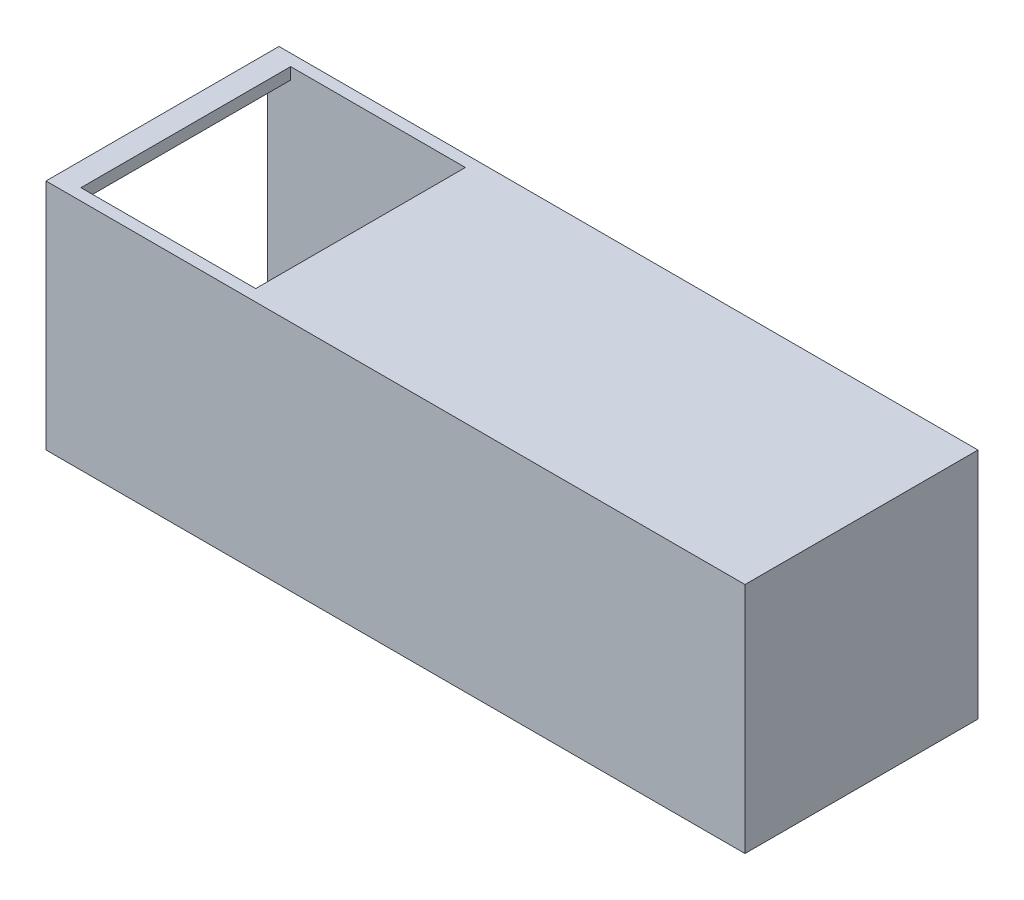
ISO-10303-21;
HEADER;
FILE_DESCRIPTION(('STEP AP214'),'2;1');
FILE_NAME('part.step','',(''),(''),'','','');
FILE_SCHEMA(('AUTOMOTIVE_DESIGN { 1 0 10303 214 1 1 1 1 }'));
ENDSEC;
DATA;
#1=APPLICATION_CONTEXT('core data for automotive mechanical design processes');
#2=APPLICATION_PROTOCOL_DEFINITION('international standard','automotive_design',2000,#1);
#3=PRODUCT_CONTEXT('',#1,'mechanical');
#4=PRODUCT('Part','Part','',(#3));
#5=PRODUCT_RELATED_PRODUCT_CATEGORY('part','',(#4));
#6=PRODUCT_DEFINITION_FORMATION('','',#4);
#7=PRODUCT_DEFINITION_CONTEXT('part definition',#1,'design');
#8=PRODUCT_DEFINITION('design','',#6,#7);
#9=PRODUCT_DEFINITION_SHAPE('','',#8);
#10=(LENGTH_UNIT() NAMED_UNIT(*) SI_UNIT(.MILLI.,.METRE.));
#11=(NAMED_UNIT(*) PLANE_ANGLE_UNIT() SI_UNIT($,.RADIAN.));
#12=(NAMED_UNIT(*) SI_UNIT($,.STERADIAN.) SOLID_ANGLE_UNIT());
#13=UNCERTAINTY_MEASURE_WITH_UNIT(LENGTH_MEASURE(1.E-05),#10,'distance_accuracy_value','');
#14=(GEOMETRIC_REPRESENTATION_CONTEXT(3) GLOBAL_UNCERTAINTY_ASSIGNED_CONTEXT((#13)) GLOBAL_UNIT_ASSIGNED_CONTEXT((#10,
#11,#12)) REPRESENTATION_CONTEXT('',''));
#15=CARTESIAN_POINT('',(0.,0.,0.));
#16=DIRECTION('',(0.,0.,1.));
#17=DIRECTION('',(1.,0.,0.));
#18=AXIS2_PLACEMENT_3D('',#15,#16,#17);
#19=CARTESIAN_POINT('',(0.,38.,0.));
#20=DIRECTION('',(0.,1.,0.));
#21=DIRECTION('',(0.,0.,1.));
#22=AXIS2_PLACEMENT_3D('',#19,#20,#21);
#23=PLANE('',#22);
#24=DIRECTION('',(-1.,0.,0.));
#25=VECTOR('',#24,1.);
#26=CARTESIAN_POINT('',(0.,38.,-38.));
#27=LINE('',#26,#25);
#28=CARTESIAN_POINT('',(-116.,38.,-38.));
#29=VERTEX_POINT('',#28);
#30=CARTESIAN_POINT('',(-120.,38.,-38.));
#31=VERTEX_POINT('',#30);
#32=EDGE_CURVE('E156',#29,#31,#27,.T.);
#33=ORIENTED_EDGE('',*,*,#32,.F.);
#34=DIRECTION('',(0.,0.,-1.));
#35=VECTOR('',#34,1.);
#36=CARTESIAN_POINT('',(-116.,38.,-38.));
#37=LINE('',#36,#35);
#38=CARTESIAN_POINT('',(-116.,38.,-1.99999999999999));
#39=VERTEX_POINT('',#38);
#40=EDGE_CURVE('E141',#39,#29,#37,.T.);
#41=ORIENTED_EDGE('',*,*,#40,.F.);
#42=DIRECTION('',(1.,0.,0.));
#43=VECTOR('',#42,1.);
#44=CARTESIAN_POINT('',(0.,38.,-2.));
#45=LINE('',#44,#43);
#46=CARTESIAN_POINT('',(-120.,38.,-1.99999999999999));
#47=VERTEX_POINT('',#46);
#48=EDGE_CURVE('E154',#47,#39,#45,.T.);
#49=ORIENTED_EDGE('',*,*,#48,.F.);
#50=DIRECTION('',(0.,0.,1.));
#51=VECTOR('',#50,1.);
#52=CARTESIAN_POINT('',(-120.,38.,0.));
#53=LINE('',#52,#51);
#54=EDGE_CURVE('E171',#31,#47,#53,.T.);
#55=ORIENTED_EDGE('',*,*,#54,.F.);
#56=EDGE_LOOP('',(#33,#41,#49,#55));
#57=FACE_BOUND('',#56,.T.);
#58=ADVANCED_FACE('F42',(#57),#23,.F.);
#59=CARTESIAN_POINT('',(0.,2.,0.));
#60=DIRECTION('',(0.,1.,0.));
#61=DIRECTION('',(0.,0.,1.));
#62=AXIS2_PLACEMENT_3D('',#59,#60,#61);
#63=PLANE('',#62);
#64=CARTESIAN_POINT('',(-20.,2.,-20.));
#65=DIRECTION('',(0.,1.,0.));
#66=DIRECTION('',(0.,0.,1.));
#67=AXIS2_PLACEMENT_3D('',#64,#65,#66);
#68=CIRCLE('',#67,18.);
#69=CARTESIAN_POINT('',(-20.,2.,-2.));
#70=VERTEX_POINT('',#69);
#71=CARTESIAN_POINT('',(-2.,2.,-20.));
#72=VERTEX_POINT('',#71);
#73=EDGE_CURVE('E242',#70,#72,#68,.T.);
#74=ORIENTED_EDGE('',*,*,#73,.F.);
#75=DIRECTION('',(1.,0.,0.));
#76=VECTOR('',#75,1.);
#77=CARTESIAN_POINT('',(0.,2.,-2.));
#78=LINE('',#77,#76);
#79=CARTESIAN_POINT('',(-2.,2.,-2.));
#80=VERTEX_POINT('',#79);
#81=EDGE_CURVE('E181',#70,#80,#78,.T.);
#82=ORIENTED_EDGE('',*,*,#81,.T.);
#83=DIRECTION('',(0.,0.,-1.));
#84=VECTOR('',#83,1.);
#85=CARTESIAN_POINT('',(-2.,2.,0.));
#86=LINE('',#85,#84);
#87=EDGE_CURVE('E251',#80,#72,#86,.T.);
#88=ORIENTED_EDGE('',*,*,#87,.T.);
#89=EDGE_LOOP('',(#74,#82,#88));
#90=FACE_BOUND('',#89,.T.);
#91=ADVANCED_FACE('F249',(#90),#63,.T.);
#92=CARTESIAN_POINT('',(-20.,2.,-20.));
#93=DIRECTION('',(0.,1.,0.));
#94=DIRECTION('',(0.,0.,1.));
#95=AXIS2_PLACEMENT_3D('',#92,#93,#94);
#96=CIRCLE('',#95,18.);
#97=CARTESIAN_POINT('',(-20.,2.,-38.));
#98=VERTEX_POINT('',#97);
#99=EDGE_CURVE('E11',#72,#98,#96,.T.);
#100=ORIENTED_EDGE('',*,*,#99,.F.);
#101=CARTESIAN_POINT('',(-2.,2.,-38.));
#102=VERTEX_POINT('',#101);
#103=EDGE_CURVE('E285',#72,#102,#86,.T.);
#104=ORIENTED_EDGE('',*,*,#103,.T.);
#105=DIRECTION('',(-1.,0.,0.));
#106=VECTOR('',#105,1.);
#107=CARTESIAN_POINT('',(0.,2.,-38.));
#108=LINE('',#107,#106);
#109=EDGE_CURVE('E190',#102,#98,#108,.T.);
#110=ORIENTED_EDGE('',*,*,#109,.T.);
#111=EDGE_LOOP('',(#100,#104,#110));
#112=FACE_BOUND('',#111,.T.);
#113=ADVANCED_FACE('F322',(#112),#63,.T.);
#114=CARTESIAN_POINT('',(-120.,40.,0.));
#115=DIRECTION('',(1.,0.,0.));
#116=DIRECTION('',(0.,0.,-1.));
#117=AXIS2_PLACEMENT_3D('',#114,#115,#116);
#118=PLANE('',#117);
#119=DIRECTION('',(0.,0.,1.));
#120=VECTOR('',#119,1.);
#121=CARTESIAN_POINT('',(-120.,0.,0.));
#122=LINE('',#121,#120);
#123=CARTESIAN_POINT('',(-120.,0.,-40.));
#124=VERTEX_POINT('',#123);
#125=CARTESIAN_POINT('',(-120.,0.,0.));
#126=VERTEX_POINT('',#125);
#127=EDGE_CURVE('E217',#124,#126,#122,.T.);
#128=ORIENTED_EDGE('',*,*,#127,.T.);
#129=DIRECTION('',(0.,-1.,0.));
#130=VECTOR('',#129,1.);
#131=CARTESIAN_POINT('',(-120.,40.,0.));
#132=LINE('',#131,#130);
#133=CARTESIAN_POINT('',(-120.,40.,0.));
#134=VERTEX_POINT('',#133);
#135=EDGE_CURVE('E225',#134,#126,#132,.T.);
#136=ORIENTED_EDGE('',*,*,#135,.F.);
#137=DIRECTION('',(0.,0.,1.));
#138=VECTOR('',#137,1.);
#139=CARTESIAN_POINT('',(-120.,40.,0.));
#140=LINE('',#139,#138);
#141=CARTESIAN_POINT('',(-120.,40.,-40.));
#142=VERTEX_POINT('',#141);
#143=EDGE_CURVE('E203',#142,#134,#140,.T.);
#144=ORIENTED_EDGE('',*,*,#143,.F.);
#145=DIRECTION('',(0.,-1.,0.));
#146=VECTOR('',#145,1.);
#147=CARTESIAN_POINT('',(-120.,40.,-40.));
#148=LINE('',#147,#146);
#149=EDGE_CURVE('E229',#142,#124,#148,.T.);
#150=ORIENTED_EDGE('',*,*,#149,.T.);
#151=EDGE_LOOP('',(#128,#136,#144,#150));
#152=FACE_BOUND('',#151,.T.);
#153=DIRECTION('',(0.,0.,1.));
#154=VECTOR('',#153,1.);
#155=CARTESIAN_POINT('',(-120.,2.,0.));
#156=LINE('',#155,#154);
#157=CARTESIAN_POINT('',(-120.,2.,-38.));
#158=VERTEX_POINT('',#157);
#159=CARTESIAN_POINT('',(-120.,2.,-1.99999999999999));
#160=VERTEX_POINT('',#159);
#161=EDGE_CURVE('E187',#158,#160,#156,.T.);
#162=ORIENTED_EDGE('',*,*,#161,.F.);
#163=DIRECTION('',(0.,-1.,0.));
#164=VECTOR('',#163,1.);
#165=CARTESIAN_POINT('',(-120.,40.,-38.));
#166=LINE('',#165,#164);
#167=EDGE_CURVE('E182',#31,#158,#166,.T.);
#168=ORIENTED_EDGE('',*,*,#167,.F.);
#169=ORIENTED_EDGE('',*,*,#54,.T.);
#170=DIRECTION('',(0.,-1.,0.));
#171=VECTOR('',#170,1.);
#172=CARTESIAN_POINT('',(-120.,40.,-1.99999999999999));
#173=LINE('',#172,#171);
#174=EDGE_CURVE('E162',#47,#160,#173,.T.);
#175=ORIENTED_EDGE('',*,*,#174,.T.);
#176=EDGE_LOOP('',(#162,#168,#169,#175));
#177=FACE_BOUND('',#176,.T.);
#178=ADVANCED_FACE('F263',(#152,#177),#118,.F.);
#179=CARTESIAN_POINT('',(0.,40.,0.));
#180=DIRECTION('',(-1.,0.,0.));
#181=DIRECTION('',(0.,0.,1.));
#182=AXIS2_PLACEMENT_3D('',#179,#180,#181);
#183=PLANE('',#182);
#184=DIRECTION('',(0.,0.,-1.));
#185=VECTOR('',#184,1.);
#186=CARTESIAN_POINT('',(0.,0.,0.));
#187=LINE('',#186,#185);
#188=CARTESIAN_POINT('',(0.,0.,0.));
#189=VERTEX_POINT('',#188);
#190=CARTESIAN_POINT('',(0.,0.,-40.));
#191=VERTEX_POINT('',#190);
#192=EDGE_CURVE('E210',#189,#191,#187,.T.);
#193=ORIENTED_EDGE('',*,*,#192,.T.);
#194=DIRECTION('',(0.,-1.,0.));
#195=VECTOR('',#194,1.);
#196=CARTESIAN_POINT('',(0.,40.,-40.));
#197=LINE('',#196,#195);
#198=CARTESIAN_POINT('',(0.,40.,-40.));
#199=VERTEX_POINT('',#198);
#200=EDGE_CURVE('E232',#199,#191,#197,.T.);
#201=ORIENTED_EDGE('',*,*,#200,.F.);
#202=DIRECTION('',(0.,0.,-1.));
#203=VECTOR('',#202,1.);
#204=CARTESIAN_POINT('',(0.,40.,0.));
#205=LINE('',#204,#203);
#206=CARTESIAN_POINT('',(0.,40.,0.));
#207=VERTEX_POINT('',#206);
#208=EDGE_CURVE('E195',#207,#199,#205,.T.);
#209=ORIENTED_EDGE('',*,*,#208,.F.);
#210=DIRECTION('',(0.,-1.,0.));
#211=VECTOR('',#210,1.);
#212=CARTESIAN_POINT('',(0.,40.,0.));
#213=LINE('',#212,#211);
#214=EDGE_CURVE('E209',#207,#189,#213,.T.);
#215=ORIENTED_EDGE('',*,*,#214,.T.);
#216=EDGE_LOOP('',(#193,#201,#209,#215));
#217=FACE_BOUND('',#216,.T.);
#218=ADVANCED_FACE('F44',(#217),#183,.F.);
#219=CARTESIAN_POINT('',(0.,40.,-40.));
#220=DIRECTION('',(0.,0.,1.));
#221=DIRECTION('',(1.,0.,0.));
#222=AXIS2_PLACEMENT_3D('',#219,#220,#221);
#223=PLANE('',#222);
#224=DIRECTION('',(-1.,0.,0.));
#225=VECTOR('',#224,1.);
#226=CARTESIAN_POINT('',(0.,0.,-40.));
#227=LINE('',#226,#225);
#228=EDGE_CURVE('E214',#191,#124,#227,.T.);
#229=ORIENTED_EDGE('',*,*,#228,.T.);
#230=ORIENTED_EDGE('',*,*,#149,.F.);
#231=DIRECTION('',(-1.,0.,0.));
#232=VECTOR('',#231,1.);
#233=CARTESIAN_POINT('',(0.,40.,-40.));
#234=LINE('',#233,#232);
#235=EDGE_CURVE('E199',#199,#142,#234,.T.);
#236=ORIENTED_EDGE('',*,*,#235,.F.);
#237=ORIENTED_EDGE('',*,*,#200,.T.);
#238=EDGE_LOOP('',(#229,#230,#236,#237));
#239=FACE_BOUND('',#238,.T.);
#240=ADVANCED_FACE('F420',(#239),#223,.F.);
#241=CARTESIAN_POINT('',(0.,40.,0.));
#242=DIRECTION('',(0.,0.,-1.));
#243=DIRECTION('',(-1.,0.,0.));
#244=AXIS2_PLACEMENT_3D('',#241,#242,#243);
#245=PLANE('',#244);
#246=DIRECTION('',(1.,0.,0.));
#247=VECTOR('',#246,1.);
#248=CARTESIAN_POINT('',(0.,0.,0.));
#249=LINE('',#248,#247);
#250=EDGE_CURVE('E200',#126,#189,#249,.T.);
#251=ORIENTED_EDGE('',*,*,#250,.T.);
#252=ORIENTED_EDGE('',*,*,#214,.F.);
#253=DIRECTION('',(1.,0.,0.));
#254=VECTOR('',#253,1.);
#255=CARTESIAN_POINT('',(0.,40.,0.));
#256=LINE('',#255,#254);
#257=EDGE_CURVE('E206',#134,#207,#256,.T.);
#258=ORIENTED_EDGE('',*,*,#257,.F.);
#259=ORIENTED_EDGE('',*,*,#135,.T.);
#260=EDGE_LOOP('',(#251,#252,#258,#259));
#261=FACE_BOUND('',#260,.T.);
#262=ADVANCED_FACE('F415',(#261),#245,.F.);
#263=CARTESIAN_POINT('',(0.,40.,0.));
#264=DIRECTION('',(0.,1.,0.));
#265=DIRECTION('',(0.,0.,1.));
#266=AXIS2_PLACEMENT_3D('',#263,#264,#265);
#267=PLANE('',#266);
#268=DIRECTION('',(0.,0.,1.));
#269=VECTOR('',#268,1.);
#270=CARTESIAN_POINT('',(-116.,40.,-38.));
#271=LINE('',#270,#269);
#272=CARTESIAN_POINT('',(-116.,40.,-38.));
#273=VERTEX_POINT('',#272);
#274=CARTESIAN_POINT('',(-116.,40.,-1.99999999999999));
#275=VERTEX_POINT('',#274);
#276=EDGE_CURVE('E58',#273,#275,#271,.T.);
#277=ORIENTED_EDGE('',*,*,#276,.F.);
#278=DIRECTION('',(-1.,0.,0.));
#279=VECTOR('',#278,1.);
#280=CARTESIAN_POINT('',(-116.,40.,-38.));
#281=LINE('',#280,#279);
#282=CARTESIAN_POINT('',(-86.,40.,-38.));
#283=VERTEX_POINT('',#282);
#284=EDGE_CURVE('E149',#283,#273,#281,.T.);
#285=ORIENTED_EDGE('',*,*,#284,.F.);
#286=DIRECTION('',(0.,0.,-1.));
#287=VECTOR('',#286,1.);
#288=CARTESIAN_POINT('',(-86.,40.,-38.));
#289=LINE('',#288,#287);
#290=CARTESIAN_POINT('',(-86.,40.,-1.99999999999999));
#291=VERTEX_POINT('',#290);
#292=EDGE_CURVE('E300',#291,#283,#289,.T.);
#293=ORIENTED_EDGE('',*,*,#292,.F.);
#294=DIRECTION('',(1.,0.,0.));
#295=VECTOR('',#294,1.);
#296=CARTESIAN_POINT('',(-116.,40.,-1.99999999999999));
#297=LINE('',#296,#295);
#298=EDGE_CURVE('E304',#275,#291,#297,.T.);
#299=ORIENTED_EDGE('',*,*,#298,.F.);
#300=EDGE_LOOP('',(#277,#285,#293,#299));
#301=FACE_BOUND('',#300,.T.);
#302=ORIENTED_EDGE('',*,*,#208,.T.);
#303=ORIENTED_EDGE('',*,*,#235,.T.);
#304=ORIENTED_EDGE('',*,*,#143,.T.);
#305=ORIENTED_EDGE('',*,*,#257,.T.);
#306=EDGE_LOOP('',(#302,#303,#304,#305));
#307=FACE_BOUND('',#306,.T.);
#308=ADVANCED_FACE('F314',(#301,#307),#267,.T.);
#309=CARTESIAN_POINT('',(0.,0.,0.));
#310=DIRECTION('',(0.,1.,0.));
#311=DIRECTION('',(0.,0.,1.));
#312=AXIS2_PLACEMENT_3D('',#309,#310,#311);
#313=PLANE('',#312);
#314=CARTESIAN_POINT('',(-20.,0.,-20.));
#315=DIRECTION('',(0.,1.,0.));
#316=DIRECTION('',(0.,0.,1.));
#317=AXIS2_PLACEMENT_3D('',#314,#315,#316);
#318=CIRCLE('',#317,18.);
#319=CARTESIAN_POINT('',(-20.,0.,-2.));
#320=VERTEX_POINT('',#319);
#321=EDGE_CURVE('E253',#320,#320,#318,.T.);
#322=ORIENTED_EDGE('',*,*,#321,.T.);
#323=EDGE_LOOP('',(#322));
#324=FACE_BOUND('',#323,.T.);
#325=ORIENTED_EDGE('',*,*,#192,.F.);
#326=ORIENTED_EDGE('',*,*,#250,.F.);
#327=ORIENTED_EDGE('',*,*,#127,.F.);
#328=ORIENTED_EDGE('',*,*,#228,.F.);
#329=EDGE_LOOP('',(#325,#326,#327,#328));
#330=FACE_BOUND('',#329,.T.);
#331=ADVANCED_FACE('F349',(#324,#330),#313,.F.);
#332=CARTESIAN_POINT('',(-2.,40.,0.));
#333=DIRECTION('',(-1.,0.,0.));
#334=DIRECTION('',(0.,0.,1.));
#335=AXIS2_PLACEMENT_3D('',#332,#333,#334);
#336=PLANE('',#335);
#337=ORIENTED_EDGE('',*,*,#87,.F.);
#338=DIRECTION('',(0.,-1.,0.));
#339=VECTOR('',#338,1.);
#340=CARTESIAN_POINT('',(-2.,40.,-2.));
#341=LINE('',#340,#339);
#342=CARTESIAN_POINT('',(-2.,38.,-2.));
#343=VERTEX_POINT('',#342);
#344=EDGE_CURVE('E164',#343,#80,#341,.T.);
#345=ORIENTED_EDGE('',*,*,#344,.F.);
#346=DIRECTION('',(0.,0.,-1.));
#347=VECTOR('',#346,1.);
#348=CARTESIAN_POINT('',(-2.,38.,0.));
#349=LINE('',#348,#347);
#350=CARTESIAN_POINT('',(-2.,38.,-38.));
#351=VERTEX_POINT('',#350);
#352=EDGE_CURVE('E180',#343,#351,#349,.T.);
#353=ORIENTED_EDGE('',*,*,#352,.T.);
#354=DIRECTION('',(0.,-1.,0.));
#355=VECTOR('',#354,1.);
#356=CARTESIAN_POINT('',(-2.,40.,-38.));
#357=LINE('',#356,#355);
#358=EDGE_CURVE('E186',#351,#102,#357,.T.);
#359=ORIENTED_EDGE('',*,*,#358,.T.);
#360=ORIENTED_EDGE('',*,*,#103,.F.);
#361=EDGE_LOOP('',(#337,#345,#353,#359,#360));
#362=FACE_BOUND('',#361,.T.);
#363=ADVANCED_FACE('F321',(#362),#336,.T.);
#364=CARTESIAN_POINT('',(0.,40.,-38.));
#365=DIRECTION('',(0.,0.,1.));
#366=DIRECTION('',(1.,0.,0.));
#367=AXIS2_PLACEMENT_3D('',#364,#365,#366);
#368=PLANE('',#367);
#369=ORIENTED_EDGE('',*,*,#109,.F.);
#370=ORIENTED_EDGE('',*,*,#358,.F.);
#371=CARTESIAN_POINT('',(-86.,38.,-38.));
#372=VERTEX_POINT('',#371);
#373=EDGE_CURVE('E174',#351,#372,#27,.T.);
#374=ORIENTED_EDGE('',*,*,#373,.T.);
#375=DIRECTION('',(0.,1.,0.));
#376=VECTOR('',#375,1.);
#377=CARTESIAN_POINT('',(-86.,-0.001000000000001,-38.));
#378=LINE('',#377,#376);
#379=EDGE_CURVE('E293',#372,#283,#378,.T.);
#380=ORIENTED_EDGE('',*,*,#379,.T.);
#381=ORIENTED_EDGE('',*,*,#284,.T.);
#382=DIRECTION('',(0.,1.,0.));
#383=VECTOR('',#382,1.);
#384=CARTESIAN_POINT('',(-116.,-0.001000000000001,-38.));
#385=LINE('',#384,#383);
#386=EDGE_CURVE('E254',#29,#273,#385,.T.);
#387=ORIENTED_EDGE('',*,*,#386,.F.);
#388=ORIENTED_EDGE('',*,*,#32,.T.);
#389=ORIENTED_EDGE('',*,*,#167,.T.);
#390=EDGE_CURVE('E260',#98,#158,#108,.T.);
#391=ORIENTED_EDGE('',*,*,#390,.F.);
#392=EDGE_LOOP('',(#369,#370,#374,#380,#381,#387,#388,#389,#391));
#393=FACE_BOUND('',#392,.T.);
#394=ADVANCED_FACE('F266',(#393),#368,.T.);
#395=CARTESIAN_POINT('',(0.,40.,-2.));
#396=DIRECTION('',(0.,0.,-1.));
#397=DIRECTION('',(-1.,0.,0.));
#398=AXIS2_PLACEMENT_3D('',#395,#396,#397);
#399=PLANE('',#398);
#400=EDGE_CURVE('E176',#160,#70,#78,.T.);
#401=ORIENTED_EDGE('',*,*,#400,.F.);
#402=ORIENTED_EDGE('',*,*,#174,.F.);
#403=ORIENTED_EDGE('',*,*,#48,.T.);
#404=DIRECTION('',(0.,1.,0.));
#405=VECTOR('',#404,1.);
#406=CARTESIAN_POINT('',(-116.,-0.001000000000001,-1.99999999999999));
#407=LINE('',#406,#405);
#408=EDGE_CURVE('E138',#39,#275,#407,.T.);
#409=ORIENTED_EDGE('',*,*,#408,.T.);
#410=ORIENTED_EDGE('',*,*,#298,.T.);
#411=DIRECTION('',(0.,1.,0.));
#412=VECTOR('',#411,1.);
#413=CARTESIAN_POINT('',(-86.,-0.001000000000001,-1.99999999999999));
#414=LINE('',#413,#412);
#415=CARTESIAN_POINT('',(-86.,38.,-1.99999999999999));
#416=VERTEX_POINT('',#415);
#417=EDGE_CURVE('E148',#416,#291,#414,.T.);
#418=ORIENTED_EDGE('',*,*,#417,.F.);
#419=EDGE_CURVE('E165',#416,#343,#45,.T.);
#420=ORIENTED_EDGE('',*,*,#419,.T.);
#421=ORIENTED_EDGE('',*,*,#344,.T.);
#422=ORIENTED_EDGE('',*,*,#81,.F.);
#423=EDGE_LOOP('',(#401,#402,#403,#409,#410,#418,#420,#421,#422));
#424=FACE_BOUND('',#423,.T.);
#425=ADVANCED_FACE('F160',(#424),#399,.T.);
#426=ORIENTED_EDGE('',*,*,#419,.F.);
#427=DIRECTION('',(0.,0.,1.));
#428=VECTOR('',#427,1.);
#429=CARTESIAN_POINT('',(-86.,38.,-38.));
#430=LINE('',#429,#428);
#431=EDGE_CURVE('E66',#372,#416,#430,.T.);
#432=ORIENTED_EDGE('',*,*,#431,.F.);
#433=ORIENTED_EDGE('',*,*,#373,.F.);
#434=ORIENTED_EDGE('',*,*,#352,.F.);
#435=EDGE_LOOP('',(#426,#432,#433,#434));
#436=FACE_BOUND('',#435,.T.);
#437=ADVANCED_FACE('F318',(#436),#23,.F.);
#438=EDGE_CURVE('E46',#98,#70,#96,.T.);
#439=ORIENTED_EDGE('',*,*,#438,.F.);
#440=ORIENTED_EDGE('',*,*,#390,.T.);
#441=ORIENTED_EDGE('',*,*,#161,.T.);
#442=ORIENTED_EDGE('',*,*,#400,.T.);
#443=EDGE_LOOP('',(#439,#440,#441,#442));
#444=FACE_BOUND('',#443,.T.);
#445=ADVANCED_FACE('F258',(#444),#63,.T.);
#446=CARTESIAN_POINT('',(-20.,0.,-20.));
#447=DIRECTION('',(0.,1.,0.));
#448=DIRECTION('',(0.,0.,1.));
#449=AXIS2_PLACEMENT_3D('',#446,#447,#448);
#450=CYLINDRICAL_SURFACE('',#449,18.);
#451=ORIENTED_EDGE('',*,*,#321,.F.);
#452=EDGE_LOOP('',(#451));
#453=FACE_BOUND('',#452,.T.);
#454=ORIENTED_EDGE('',*,*,#73,.T.);
#455=ORIENTED_EDGE('',*,*,#99,.T.);
#456=ORIENTED_EDGE('',*,*,#438,.T.);
#457=EDGE_LOOP('',(#454,#455,#456));
#458=FACE_BOUND('',#457,.T.);
#459=ADVANCED_FACE('F241',(#453,#458),#450,.F.);
#460=CARTESIAN_POINT('',(-116.,-0.001000000000001,-38.));
#461=DIRECTION('',(-1.,0.,0.));
#462=DIRECTION('',(0.,0.,1.));
#463=AXIS2_PLACEMENT_3D('',#460,#461,#462);
#464=PLANE('',#463);
#465=ORIENTED_EDGE('',*,*,#40,.T.);
#466=ORIENTED_EDGE('',*,*,#386,.T.);
#467=ORIENTED_EDGE('',*,*,#276,.T.);
#468=ORIENTED_EDGE('',*,*,#408,.F.);
#469=EDGE_LOOP('',(#465,#466,#467,#468));
#470=FACE_BOUND('',#469,.T.);
#471=ADVANCED_FACE('F140',(#470),#464,.F.);
#472=CARTESIAN_POINT('',(-86.,-0.001000000000001,-38.));
#473=DIRECTION('',(1.,0.,0.));
#474=DIRECTION('',(0.,0.,-1.));
#475=AXIS2_PLACEMENT_3D('',#472,#473,#474);
#476=PLANE('',#475);
#477=ORIENTED_EDGE('',*,*,#431,.T.);
#478=ORIENTED_EDGE('',*,*,#417,.T.);
#479=ORIENTED_EDGE('',*,*,#292,.T.);
#480=ORIENTED_EDGE('',*,*,#379,.F.);
#481=EDGE_LOOP('',(#477,#478,#479,#480));
#482=FACE_BOUND('',#481,.T.);
#483=ADVANCED_FACE('F316',(#482),#476,.F.);
#484=CLOSED_SHELL('',(#58,#91,#113,#178,#218,#240,#262,#308,#331,#363,#394,#425,#437,#445,#459,
#471,#483));
#485=MANIFOLD_SOLID_BREP('B2',#484);
#486=ADVANCED_BREP_SHAPE_REPRESENTATION('',(#18,#485),#14);
#487=SHAPE_DEFINITION_REPRESENTATION(#9,#486);
ENDSEC;
END-ISO-10303-21;
